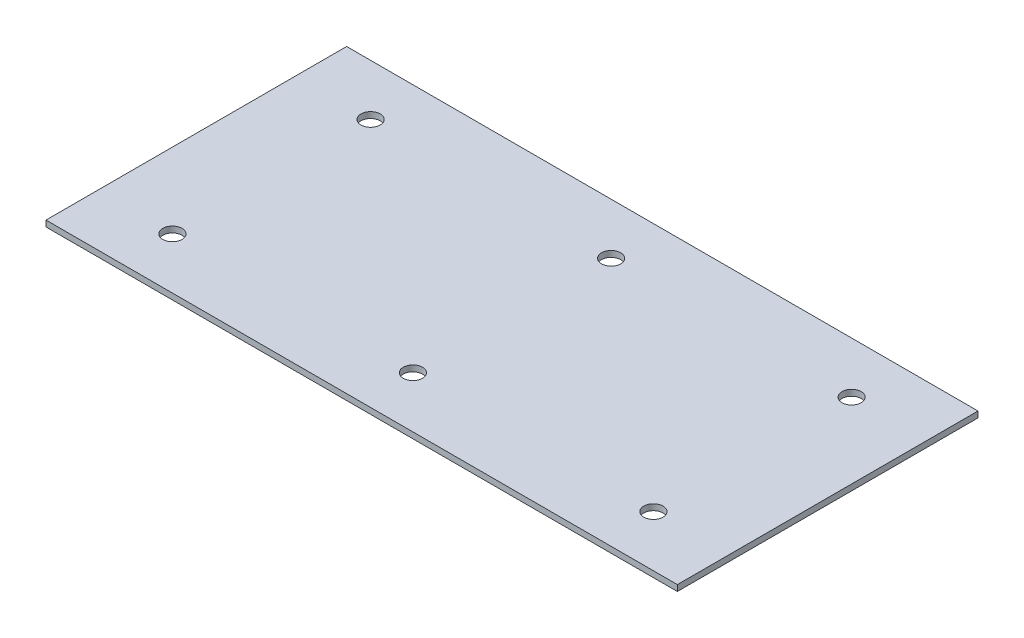
ISO-10303-21;
HEADER;
FILE_DESCRIPTION(('STEP AP214'),'2;1');
FILE_NAME('part.step','',(''),(''),'','','');
FILE_SCHEMA(('AUTOMOTIVE_DESIGN { 1 0 10303 214 1 1 1 1 }'));
ENDSEC;
DATA;
#1=APPLICATION_CONTEXT('core data for automotive mechanical design processes');
#2=APPLICATION_PROTOCOL_DEFINITION('international standard','automotive_design',2000,#1);
#3=PRODUCT_CONTEXT('',#1,'mechanical');
#4=PRODUCT('Part','Part','',(#3));
#5=PRODUCT_RELATED_PRODUCT_CATEGORY('part','',(#4));
#6=PRODUCT_DEFINITION_FORMATION('','',#4);
#7=PRODUCT_DEFINITION_CONTEXT('part definition',#1,'design');
#8=PRODUCT_DEFINITION('design','',#6,#7);
#9=PRODUCT_DEFINITION_SHAPE('','',#8);
#10=(LENGTH_UNIT() NAMED_UNIT(*) SI_UNIT(.MILLI.,.METRE.));
#11=(NAMED_UNIT(*) PLANE_ANGLE_UNIT() SI_UNIT($,.RADIAN.));
#12=(NAMED_UNIT(*) SI_UNIT($,.STERADIAN.) SOLID_ANGLE_UNIT());
#13=UNCERTAINTY_MEASURE_WITH_UNIT(LENGTH_MEASURE(1.E-05),#10,'distance_accuracy_value','');
#14=(GEOMETRIC_REPRESENTATION_CONTEXT(3) GLOBAL_UNCERTAINTY_ASSIGNED_CONTEXT((#13)) GLOBAL_UNIT_ASSIGNED_CONTEXT((#10,
#11,#12)) REPRESENTATION_CONTEXT('',''));
#15=CARTESIAN_POINT('',(0.,0.,0.));
#16=DIRECTION('',(0.,0.,1.));
#17=DIRECTION('',(1.,0.,0.));
#18=AXIS2_PLACEMENT_3D('',#15,#16,#17);
#19=CARTESIAN_POINT('',(0.,2.,0.));
#20=DIRECTION('',(0.,-1.,0.));
#21=DIRECTION('',(0.,0.,-1.));
#22=AXIS2_PLACEMENT_3D('',#19,#20,#21);
#23=PLANE('',#22);
#24=DIRECTION('',(0.,0.,1.));
#25=VECTOR('',#24,1.);
#26=CARTESIAN_POINT('',(0.,2.,0.));
#27=LINE('',#26,#25);
#28=CARTESIAN_POINT('',(0.,2.,-100.));
#29=VERTEX_POINT('',#28);
#30=CARTESIAN_POINT('',(0.,2.,0.));
#31=VERTEX_POINT('',#30);
#32=EDGE_CURVE('E86',#29,#31,#27,.T.);
#33=ORIENTED_EDGE('',*,*,#32,.T.);
#34=DIRECTION('',(1.,0.,0.));
#35=VECTOR('',#34,1.);
#36=CARTESIAN_POINT('',(0.,2.,0.));
#37=LINE('',#36,#35);
#38=CARTESIAN_POINT('',(210.,2.,0.));
#39=VERTEX_POINT('',#38);
#40=EDGE_CURVE('E81',#31,#39,#37,.T.);
#41=ORIENTED_EDGE('',*,*,#40,.T.);
#42=DIRECTION('',(0.,0.,-1.));
#43=VECTOR('',#42,1.);
#44=CARTESIAN_POINT('',(210.,2.,0.));
#45=LINE('',#44,#43);
#46=CARTESIAN_POINT('',(210.,2.,-100.));
#47=VERTEX_POINT('',#46);
#48=EDGE_CURVE('E84',#39,#47,#45,.T.);
#49=ORIENTED_EDGE('',*,*,#48,.T.);
#50=DIRECTION('',(-1.,0.,0.));
#51=VECTOR('',#50,1.);
#52=CARTESIAN_POINT('',(0.,2.,-100.));
#53=LINE('',#52,#51);
#54=EDGE_CURVE('E51',#47,#29,#53,.T.);
#55=ORIENTED_EDGE('',*,*,#54,.T.);
#56=EDGE_LOOP('',(#33,#41,#49,#55));
#57=FACE_BOUND('',#56,.T.);
#58=CARTESIAN_POINT('',(24.9999999999997,2.,-17.0342478014982));
#59=DIRECTION('',(0.,1.,0.));
#60=DIRECTION('',(0.,0.,1.));
#61=AXIS2_PLACEMENT_3D('',#58,#59,#60);
#62=CIRCLE('',#61,3.2);
#63=CARTESIAN_POINT('',(24.9999999999997,2.,-13.8342478014982));
#64=VERTEX_POINT('',#63);
#65=EDGE_CURVE('E101',#64,#64,#62,.T.);
#66=ORIENTED_EDGE('',*,*,#65,.F.);
#67=EDGE_LOOP('',(#66));
#68=FACE_BOUND('',#67,.T.);
#69=CARTESIAN_POINT('',(185.,2.,-17.0342478014989));
#70=DIRECTION('',(0.,1.,0.));
#71=DIRECTION('',(0.,0.,1.));
#72=AXIS2_PLACEMENT_3D('',#69,#70,#71);
#73=CIRCLE('',#72,3.20000000000001);
#74=CARTESIAN_POINT('',(185.,2.,-13.8342478014989));
#75=VERTEX_POINT('',#74);
#76=EDGE_CURVE('E116',#75,#75,#73,.T.);
#77=ORIENTED_EDGE('',*,*,#76,.F.);
#78=EDGE_LOOP('',(#77));
#79=FACE_BOUND('',#78,.T.);
#80=CARTESIAN_POINT('',(105.,2.,-17.0342478014982));
#81=DIRECTION('',(0.,1.,0.));
#82=DIRECTION('',(0.,0.,1.));
#83=AXIS2_PLACEMENT_3D('',#80,#81,#82);
#84=CIRCLE('',#83,3.20000000000024);
#85=CARTESIAN_POINT('',(105.,2.,-13.834247801498));
#86=VERTEX_POINT('',#85);
#87=EDGE_CURVE('E122',#86,#86,#84,.T.);
#88=ORIENTED_EDGE('',*,*,#87,.F.);
#89=EDGE_LOOP('',(#88));
#90=FACE_BOUND('',#89,.T.);
#91=CARTESIAN_POINT('',(24.9999999999997,2.,-82.9657521985011));
#92=DIRECTION('',(0.,1.,0.));
#93=DIRECTION('',(0.,0.,-1.));
#94=AXIS2_PLACEMENT_3D('',#91,#92,#93);
#95=CIRCLE('',#94,3.19999999999999);
#96=CARTESIAN_POINT('',(24.9999999999997,2.,-86.1657521985011));
#97=VERTEX_POINT('',#96);
#98=EDGE_CURVE('E128',#97,#97,#95,.T.);
#99=ORIENTED_EDGE('',*,*,#98,.F.);
#100=EDGE_LOOP('',(#99));
#101=FACE_BOUND('',#100,.T.);
#102=CARTESIAN_POINT('',(105.,2.,-82.9657521985014));
#103=DIRECTION('',(0.,1.,0.));
#104=DIRECTION('',(0.,0.,-1.));
#105=AXIS2_PLACEMENT_3D('',#102,#103,#104);
#106=CIRCLE('',#105,3.20000000000018);
#107=CARTESIAN_POINT('',(105.,2.,-86.1657521985016));
#108=VERTEX_POINT('',#107);
#109=EDGE_CURVE('E134',#108,#108,#106,.T.);
#110=ORIENTED_EDGE('',*,*,#109,.F.);
#111=EDGE_LOOP('',(#110));
#112=FACE_BOUND('',#111,.T.);
#113=CARTESIAN_POINT('',(185.,2.,-82.9657521985012));
#114=DIRECTION('',(0.,1.,0.));
#115=DIRECTION('',(0.,0.,-1.));
#116=AXIS2_PLACEMENT_3D('',#113,#114,#115);
#117=CIRCLE('',#116,3.20000000000001);
#118=CARTESIAN_POINT('',(185.,2.,-86.1657521985012));
#119=VERTEX_POINT('',#118);
#120=EDGE_CURVE('E140',#119,#119,#117,.T.);
#121=ORIENTED_EDGE('',*,*,#120,.F.);
#122=EDGE_LOOP('',(#121));
#123=FACE_BOUND('',#122,.T.);
#124=ADVANCED_FACE('F34',(#57,#68,#79,#90,#101,#112,#123),#23,.F.);
#125=CARTESIAN_POINT('',(0.,0.,0.));
#126=DIRECTION('',(0.,-1.,0.));
#127=DIRECTION('',(0.,0.,-1.));
#128=AXIS2_PLACEMENT_3D('',#125,#126,#127);
#129=PLANE('',#128);
#130=CARTESIAN_POINT('',(105.,0.,-82.9657521985014));
#131=DIRECTION('',(0.,1.,0.));
#132=DIRECTION('',(0.,0.,-1.));
#133=AXIS2_PLACEMENT_3D('',#130,#131,#132);
#134=CIRCLE('',#133,3.20000000000018);
#135=CARTESIAN_POINT('',(105.,0.,-86.1657521985016));
#136=VERTEX_POINT('',#135);
#137=EDGE_CURVE('E137',#136,#136,#134,.T.);
#138=ORIENTED_EDGE('',*,*,#137,.T.);
#139=EDGE_LOOP('',(#138));
#140=FACE_BOUND('',#139,.T.);
#141=CARTESIAN_POINT('',(105.,0.,-17.0342478014982));
#142=DIRECTION('',(0.,1.,0.));
#143=DIRECTION('',(0.,0.,1.));
#144=AXIS2_PLACEMENT_3D('',#141,#142,#143);
#145=CIRCLE('',#144,3.20000000000024);
#146=CARTESIAN_POINT('',(105.,0.,-13.834247801498));
#147=VERTEX_POINT('',#146);
#148=EDGE_CURVE('E125',#147,#147,#145,.T.);
#149=ORIENTED_EDGE('',*,*,#148,.T.);
#150=EDGE_LOOP('',(#149));
#151=FACE_BOUND('',#150,.T.);
#152=CARTESIAN_POINT('',(24.9999999999997,0.,-17.0342478014982));
#153=DIRECTION('',(0.,1.,0.));
#154=DIRECTION('',(0.,0.,1.));
#155=AXIS2_PLACEMENT_3D('',#152,#153,#154);
#156=CIRCLE('',#155,3.2);
#157=CARTESIAN_POINT('',(24.9999999999997,0.,-13.8342478014982));
#158=VERTEX_POINT('',#157);
#159=EDGE_CURVE('E113',#158,#158,#156,.T.);
#160=ORIENTED_EDGE('',*,*,#159,.T.);
#161=EDGE_LOOP('',(#160));
#162=FACE_BOUND('',#161,.T.);
#163=DIRECTION('',(0.,0.,1.));
#164=VECTOR('',#163,1.);
#165=CARTESIAN_POINT('',(0.,0.,0.));
#166=LINE('',#165,#164);
#167=CARTESIAN_POINT('',(0.,0.,-100.));
#168=VERTEX_POINT('',#167);
#169=CARTESIAN_POINT('',(0.,0.,0.));
#170=VERTEX_POINT('',#169);
#171=EDGE_CURVE('E98',#168,#170,#166,.T.);
#172=ORIENTED_EDGE('',*,*,#171,.F.);
#173=DIRECTION('',(-1.,0.,0.));
#174=VECTOR('',#173,1.);
#175=CARTESIAN_POINT('',(0.,0.,-100.));
#176=LINE('',#175,#174);
#177=CARTESIAN_POINT('',(210.,0.,-100.));
#178=VERTEX_POINT('',#177);
#179=EDGE_CURVE('E74',#178,#168,#176,.T.);
#180=ORIENTED_EDGE('',*,*,#179,.F.);
#181=DIRECTION('',(0.,0.,-1.));
#182=VECTOR('',#181,1.);
#183=CARTESIAN_POINT('',(210.,0.,0.));
#184=LINE('',#183,#182);
#185=CARTESIAN_POINT('',(210.,0.,0.));
#186=VERTEX_POINT('',#185);
#187=EDGE_CURVE('E68',#186,#178,#184,.T.);
#188=ORIENTED_EDGE('',*,*,#187,.F.);
#189=DIRECTION('',(1.,0.,0.));
#190=VECTOR('',#189,1.);
#191=CARTESIAN_POINT('',(0.,0.,0.));
#192=LINE('',#191,#190);
#193=EDGE_CURVE('E90',#170,#186,#192,.T.);
#194=ORIENTED_EDGE('',*,*,#193,.F.);
#195=EDGE_LOOP('',(#172,#180,#188,#194));
#196=FACE_BOUND('',#195,.T.);
#197=CARTESIAN_POINT('',(185.,0.,-17.0342478014989));
#198=DIRECTION('',(0.,1.,0.));
#199=DIRECTION('',(0.,0.,1.));
#200=AXIS2_PLACEMENT_3D('',#197,#198,#199);
#201=CIRCLE('',#200,3.20000000000001);
#202=CARTESIAN_POINT('',(185.,0.,-13.8342478014989));
#203=VERTEX_POINT('',#202);
#204=EDGE_CURVE('E119',#203,#203,#201,.T.);
#205=ORIENTED_EDGE('',*,*,#204,.T.);
#206=EDGE_LOOP('',(#205));
#207=FACE_BOUND('',#206,.T.);
#208=CARTESIAN_POINT('',(24.9999999999997,0.,-82.9657521985011));
#209=DIRECTION('',(0.,1.,0.));
#210=DIRECTION('',(0.,0.,-1.));
#211=AXIS2_PLACEMENT_3D('',#208,#209,#210);
#212=CIRCLE('',#211,3.19999999999999);
#213=CARTESIAN_POINT('',(24.9999999999997,0.,-86.1657521985011));
#214=VERTEX_POINT('',#213);
#215=EDGE_CURVE('E131',#214,#214,#212,.T.);
#216=ORIENTED_EDGE('',*,*,#215,.T.);
#217=EDGE_LOOP('',(#216));
#218=FACE_BOUND('',#217,.T.);
#219=CARTESIAN_POINT('',(185.,0.,-82.9657521985012));
#220=DIRECTION('',(0.,1.,0.));
#221=DIRECTION('',(0.,0.,-1.));
#222=AXIS2_PLACEMENT_3D('',#219,#220,#221);
#223=CIRCLE('',#222,3.20000000000001);
#224=CARTESIAN_POINT('',(185.,0.,-86.1657521985012));
#225=VERTEX_POINT('',#224);
#226=EDGE_CURVE('E143',#225,#225,#223,.T.);
#227=ORIENTED_EDGE('',*,*,#226,.T.);
#228=EDGE_LOOP('',(#227));
#229=FACE_BOUND('',#228,.T.);
#230=ADVANCED_FACE('F109',(#140,#151,#162,#196,#207,#218,#229),#129,.T.);
#231=CARTESIAN_POINT('',(0.,2.,0.));
#232=DIRECTION('',(1.,0.,0.));
#233=DIRECTION('',(0.,0.,-1.));
#234=AXIS2_PLACEMENT_3D('',#231,#232,#233);
#235=PLANE('',#234);
#236=ORIENTED_EDGE('',*,*,#171,.T.);
#237=DIRECTION('',(0.,-1.,0.));
#238=VECTOR('',#237,1.);
#239=CARTESIAN_POINT('',(0.,2.,0.));
#240=LINE('',#239,#238);
#241=EDGE_CURVE('E11',#31,#170,#240,.T.);
#242=ORIENTED_EDGE('',*,*,#241,.F.);
#243=ORIENTED_EDGE('',*,*,#32,.F.);
#244=DIRECTION('',(0.,-1.,0.));
#245=VECTOR('',#244,1.);
#246=CARTESIAN_POINT('',(0.,2.,-100.));
#247=LINE('',#246,#245);
#248=EDGE_CURVE('E94',#29,#168,#247,.T.);
#249=ORIENTED_EDGE('',*,*,#248,.T.);
#250=EDGE_LOOP('',(#236,#242,#243,#249));
#251=FACE_BOUND('',#250,.T.);
#252=ADVANCED_FACE('F36',(#251),#235,.F.);
#253=CARTESIAN_POINT('',(0.,2.,0.));
#254=DIRECTION('',(0.,0.,-1.));
#255=DIRECTION('',(-1.,0.,0.));
#256=AXIS2_PLACEMENT_3D('',#253,#254,#255);
#257=PLANE('',#256);
#258=ORIENTED_EDGE('',*,*,#193,.T.);
#259=DIRECTION('',(0.,-1.,0.));
#260=VECTOR('',#259,1.);
#261=CARTESIAN_POINT('',(210.,2.,0.));
#262=LINE('',#261,#260);
#263=EDGE_CURVE('E43',#39,#186,#262,.T.);
#264=ORIENTED_EDGE('',*,*,#263,.F.);
#265=ORIENTED_EDGE('',*,*,#40,.F.);
#266=ORIENTED_EDGE('',*,*,#241,.T.);
#267=EDGE_LOOP('',(#258,#264,#265,#266));
#268=FACE_BOUND('',#267,.T.);
#269=ADVANCED_FACE('F89',(#268),#257,.F.);
#270=CARTESIAN_POINT('',(210.,2.,0.));
#271=DIRECTION('',(-1.,0.,0.));
#272=DIRECTION('',(0.,0.,1.));
#273=AXIS2_PLACEMENT_3D('',#270,#271,#272);
#274=PLANE('',#273);
#275=ORIENTED_EDGE('',*,*,#187,.T.);
#276=DIRECTION('',(0.,-1.,0.));
#277=VECTOR('',#276,1.);
#278=CARTESIAN_POINT('',(210.,2.,-100.));
#279=LINE('',#278,#277);
#280=EDGE_CURVE('E91',#47,#178,#279,.T.);
#281=ORIENTED_EDGE('',*,*,#280,.F.);
#282=ORIENTED_EDGE('',*,*,#48,.F.);
#283=ORIENTED_EDGE('',*,*,#263,.T.);
#284=EDGE_LOOP('',(#275,#281,#282,#283));
#285=FACE_BOUND('',#284,.T.);
#286=ADVANCED_FACE('F92',(#285),#274,.F.);
#287=CARTESIAN_POINT('',(0.,2.,-100.));
#288=DIRECTION('',(0.,0.,1.));
#289=DIRECTION('',(1.,0.,0.));
#290=AXIS2_PLACEMENT_3D('',#287,#288,#289);
#291=PLANE('',#290);
#292=ORIENTED_EDGE('',*,*,#179,.T.);
#293=ORIENTED_EDGE('',*,*,#248,.F.);
#294=ORIENTED_EDGE('',*,*,#54,.F.);
#295=ORIENTED_EDGE('',*,*,#280,.T.);
#296=EDGE_LOOP('',(#292,#293,#294,#295));
#297=FACE_BOUND('',#296,.T.);
#298=ADVANCED_FACE('F106',(#297),#291,.F.);
#299=CARTESIAN_POINT('',(24.9999999999997,2.,-17.0342478014982));
#300=DIRECTION('',(0.,-1.,0.));
#301=DIRECTION('',(0.,0.,-1.));
#302=AXIS2_PLACEMENT_3D('',#299,#300,#301);
#303=CYLINDRICAL_SURFACE('',#302,3.2);
#304=ORIENTED_EDGE('',*,*,#65,.T.);
#305=EDGE_LOOP('',(#304));
#306=FACE_BOUND('',#305,.T.);
#307=ORIENTED_EDGE('',*,*,#159,.F.);
#308=EDGE_LOOP('',(#307));
#309=FACE_BOUND('',#308,.T.);
#310=ADVANCED_FACE('F160',(#306,#309),#303,.F.);
#311=CARTESIAN_POINT('',(185.,2.,-17.0342478014989));
#312=DIRECTION('',(0.,-1.,0.));
#313=DIRECTION('',(0.,0.,-1.));
#314=AXIS2_PLACEMENT_3D('',#311,#312,#313);
#315=CYLINDRICAL_SURFACE('',#314,3.20000000000001);
#316=ORIENTED_EDGE('',*,*,#76,.T.);
#317=EDGE_LOOP('',(#316));
#318=FACE_BOUND('',#317,.T.);
#319=ORIENTED_EDGE('',*,*,#204,.F.);
#320=EDGE_LOOP('',(#319));
#321=FACE_BOUND('',#320,.T.);
#322=ADVANCED_FACE('F206',(#318,#321),#315,.F.);
#323=CARTESIAN_POINT('',(105.,2.,-17.0342478014982));
#324=DIRECTION('',(0.,-1.,0.));
#325=DIRECTION('',(0.,0.,-1.));
#326=AXIS2_PLACEMENT_3D('',#323,#324,#325);
#327=CYLINDRICAL_SURFACE('',#326,3.20000000000024);
#328=ORIENTED_EDGE('',*,*,#87,.T.);
#329=EDGE_LOOP('',(#328));
#330=FACE_BOUND('',#329,.T.);
#331=ORIENTED_EDGE('',*,*,#148,.F.);
#332=EDGE_LOOP('',(#331));
#333=FACE_BOUND('',#332,.T.);
#334=ADVANCED_FACE('F214',(#330,#333),#327,.F.);
#335=CARTESIAN_POINT('',(24.9999999999997,2.,-82.9657521985011));
#336=DIRECTION('',(0.,-1.,0.));
#337=DIRECTION('',(0.,0.,-1.));
#338=AXIS2_PLACEMENT_3D('',#335,#336,#337);
#339=CYLINDRICAL_SURFACE('',#338,3.19999999999999);
#340=ORIENTED_EDGE('',*,*,#98,.T.);
#341=EDGE_LOOP('',(#340));
#342=FACE_BOUND('',#341,.T.);
#343=ORIENTED_EDGE('',*,*,#215,.F.);
#344=EDGE_LOOP('',(#343));
#345=FACE_BOUND('',#344,.T.);
#346=ADVANCED_FACE('F222',(#342,#345),#339,.F.);
#347=CARTESIAN_POINT('',(105.,2.,-82.9657521985014));
#348=DIRECTION('',(0.,-1.,0.));
#349=DIRECTION('',(0.,0.,-1.));
#350=AXIS2_PLACEMENT_3D('',#347,#348,#349);
#351=CYLINDRICAL_SURFACE('',#350,3.20000000000018);
#352=ORIENTED_EDGE('',*,*,#109,.T.);
#353=EDGE_LOOP('',(#352));
#354=FACE_BOUND('',#353,.T.);
#355=ORIENTED_EDGE('',*,*,#137,.F.);
#356=EDGE_LOOP('',(#355));
#357=FACE_BOUND('',#356,.T.);
#358=ADVANCED_FACE('F231',(#354,#357),#351,.F.);
#359=CARTESIAN_POINT('',(185.,2.,-82.9657521985012));
#360=DIRECTION('',(0.,-1.,0.));
#361=DIRECTION('',(0.,0.,-1.));
#362=AXIS2_PLACEMENT_3D('',#359,#360,#361);
#363=CYLINDRICAL_SURFACE('',#362,3.20000000000001);
#364=ORIENTED_EDGE('',*,*,#120,.T.);
#365=EDGE_LOOP('',(#364));
#366=FACE_BOUND('',#365,.T.);
#367=ORIENTED_EDGE('',*,*,#226,.F.);
#368=EDGE_LOOP('',(#367));
#369=FACE_BOUND('',#368,.T.);
#370=ADVANCED_FACE('F149',(#366,#369),#363,.F.);
#371=CLOSED_SHELL('',(#124,#230,#252,#269,#286,#298,#310,#322,#334,#346,#358,#370));
#372=MANIFOLD_SOLID_BREP('B2',#371);
#373=ADVANCED_BREP_SHAPE_REPRESENTATION('',(#18,#372),#14);
#374=SHAPE_DEFINITION_REPRESENTATION(#9,#373);
ENDSEC;
END-ISO-10303-21;
